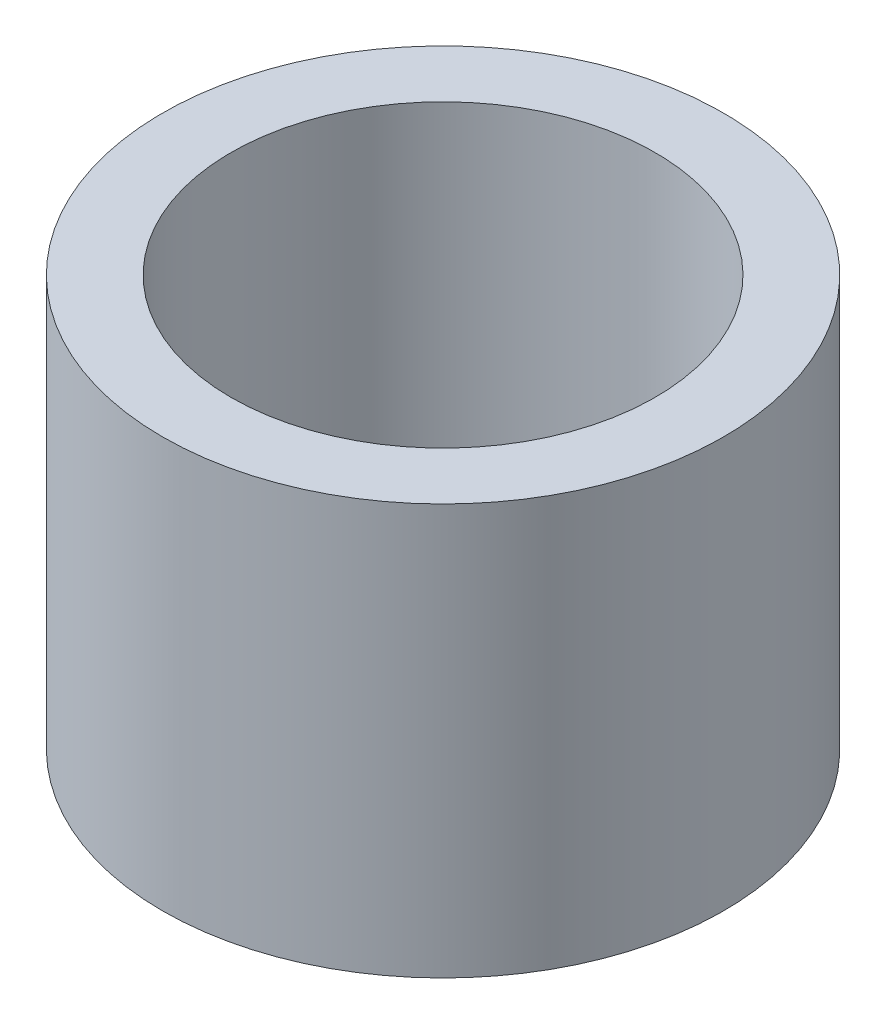
ISO-10303-21;
HEADER;
FILE_DESCRIPTION(('STEP AP214'),'2;1');
FILE_NAME('part.step','',(''),(''),'','','');
FILE_SCHEMA(('AUTOMOTIVE_DESIGN { 1 0 10303 214 1 1 1 1 }'));
ENDSEC;
DATA;
#1=APPLICATION_CONTEXT('core data for automotive mechanical design processes');
#2=APPLICATION_PROTOCOL_DEFINITION('international standard','automotive_design',2000,#1);
#3=PRODUCT_CONTEXT('',#1,'mechanical');
#4=PRODUCT('Part','Part','',(#3));
#5=PRODUCT_RELATED_PRODUCT_CATEGORY('part','',(#4));
#6=PRODUCT_DEFINITION_FORMATION('','',#4);
#7=PRODUCT_DEFINITION_CONTEXT('part definition',#1,'design');
#8=PRODUCT_DEFINITION('design','',#6,#7);
#9=PRODUCT_DEFINITION_SHAPE('','',#8);
#10=(LENGTH_UNIT() NAMED_UNIT(*) SI_UNIT(.MILLI.,.METRE.));
#11=(NAMED_UNIT(*) PLANE_ANGLE_UNIT() SI_UNIT($,.RADIAN.));
#12=(NAMED_UNIT(*) SI_UNIT($,.STERADIAN.) SOLID_ANGLE_UNIT());
#13=UNCERTAINTY_MEASURE_WITH_UNIT(LENGTH_MEASURE(1.E-05),#10,'distance_accuracy_value','');
#14=(GEOMETRIC_REPRESENTATION_CONTEXT(3) GLOBAL_UNCERTAINTY_ASSIGNED_CONTEXT((#13)) GLOBAL_UNIT_ASSIGNED_CONTEXT((#10,
#11,#12)) REPRESENTATION_CONTEXT('',''));
#15=CARTESIAN_POINT('',(0.,0.,0.));
#16=DIRECTION('',(0.,0.,1.));
#17=DIRECTION('',(1.,0.,0.));
#18=AXIS2_PLACEMENT_3D('',#15,#16,#17);
#19=CARTESIAN_POINT('',(0.,6.,0.));
#20=DIRECTION('',(0.,1.,0.));
#21=DIRECTION('',(0.,0.,1.));
#22=AXIS2_PLACEMENT_3D('',#19,#20,#21);
#23=PLANE('',#22);
#24=CARTESIAN_POINT('',(0.,6.,0.));
#25=DIRECTION('',(0.,1.,0.));
#26=DIRECTION('',(0.,0.,1.));
#27=AXIS2_PLACEMENT_3D('',#24,#25,#26);
#28=CIRCLE('',#27,4.1);
#29=CARTESIAN_POINT('',(0.,6.,4.1));
#30=VERTEX_POINT('',#29);
#31=EDGE_CURVE('E10',#30,#30,#28,.T.);
#32=ORIENTED_EDGE('',*,*,#31,.T.);
#33=EDGE_LOOP('',(#32));
#34=FACE_BOUND('',#33,.T.);
#35=CARTESIAN_POINT('',(0.,6.,0.));
#36=DIRECTION('',(0.,1.,0.));
#37=DIRECTION('',(0.,0.,1.));
#38=AXIS2_PLACEMENT_3D('',#35,#36,#37);
#39=CIRCLE('',#38,3.1);
#40=CARTESIAN_POINT('',(0.,6.,3.1));
#41=VERTEX_POINT('',#40);
#42=EDGE_CURVE('E41',#41,#41,#39,.T.);
#43=ORIENTED_EDGE('',*,*,#42,.F.);
#44=EDGE_LOOP('',(#43));
#45=FACE_BOUND('',#44,.T.);
#46=ADVANCED_FACE('F30',(#34,#45),#23,.T.);
#47=CARTESIAN_POINT('',(0.,0.,0.));
#48=DIRECTION('',(0.,1.,0.));
#49=DIRECTION('',(0.,0.,1.));
#50=AXIS2_PLACEMENT_3D('',#47,#48,#49);
#51=PLANE('',#50);
#52=CARTESIAN_POINT('',(0.,0.,0.));
#53=DIRECTION('',(0.,1.,0.));
#54=DIRECTION('',(0.,0.,1.));
#55=AXIS2_PLACEMENT_3D('',#52,#53,#54);
#56=CIRCLE('',#55,4.1);
#57=CARTESIAN_POINT('',(0.,0.,4.1));
#58=VERTEX_POINT('',#57);
#59=EDGE_CURVE('E34',#58,#58,#56,.T.);
#60=ORIENTED_EDGE('',*,*,#59,.F.);
#61=EDGE_LOOP('',(#60));
#62=FACE_BOUND('',#61,.T.);
#63=CARTESIAN_POINT('',(0.,0.,0.));
#64=DIRECTION('',(0.,1.,0.));
#65=DIRECTION('',(0.,0.,1.));
#66=AXIS2_PLACEMENT_3D('',#63,#64,#65);
#67=CIRCLE('',#66,3.1);
#68=CARTESIAN_POINT('',(0.,0.,3.1));
#69=VERTEX_POINT('',#68);
#70=EDGE_CURVE('E43',#69,#69,#67,.T.);
#71=ORIENTED_EDGE('',*,*,#70,.T.);
#72=EDGE_LOOP('',(#71));
#73=FACE_BOUND('',#72,.T.);
#74=ADVANCED_FACE('F53',(#62,#73),#51,.F.);
#75=CARTESIAN_POINT('',(0.,6.,0.));
#76=DIRECTION('',(0.,-1.,0.));
#77=DIRECTION('',(0.,0.,-1.));
#78=AXIS2_PLACEMENT_3D('',#75,#76,#77);
#79=CYLINDRICAL_SURFACE('',#78,4.1);
#80=ORIENTED_EDGE('',*,*,#31,.F.);
#81=EDGE_LOOP('',(#80));
#82=FACE_BOUND('',#81,.T.);
#83=ORIENTED_EDGE('',*,*,#59,.T.);
#84=EDGE_LOOP('',(#83));
#85=FACE_BOUND('',#84,.T.);
#86=ADVANCED_FACE('F32',(#82,#85),#79,.T.);
#87=CARTESIAN_POINT('',(0.,6.,0.));
#88=DIRECTION('',(0.,-1.,0.));
#89=DIRECTION('',(0.,0.,-1.));
#90=AXIS2_PLACEMENT_3D('',#87,#88,#89);
#91=CYLINDRICAL_SURFACE('',#90,3.1);
#92=ORIENTED_EDGE('',*,*,#42,.T.);
#93=EDGE_LOOP('',(#92));
#94=FACE_BOUND('',#93,.T.);
#95=ORIENTED_EDGE('',*,*,#70,.F.);
#96=EDGE_LOOP('',(#95));
#97=FACE_BOUND('',#96,.T.);
#98=ADVANCED_FACE('F49',(#94,#97),#91,.F.);
#99=CLOSED_SHELL('',(#46,#74,#86,#98));
#100=MANIFOLD_SOLID_BREP('B2',#99);
#101=ADVANCED_BREP_SHAPE_REPRESENTATION('',(#18,#100),#14);
#102=SHAPE_DEFINITION_REPRESENTATION(#9,#101);
ENDSEC;
END-ISO-10303-21;
